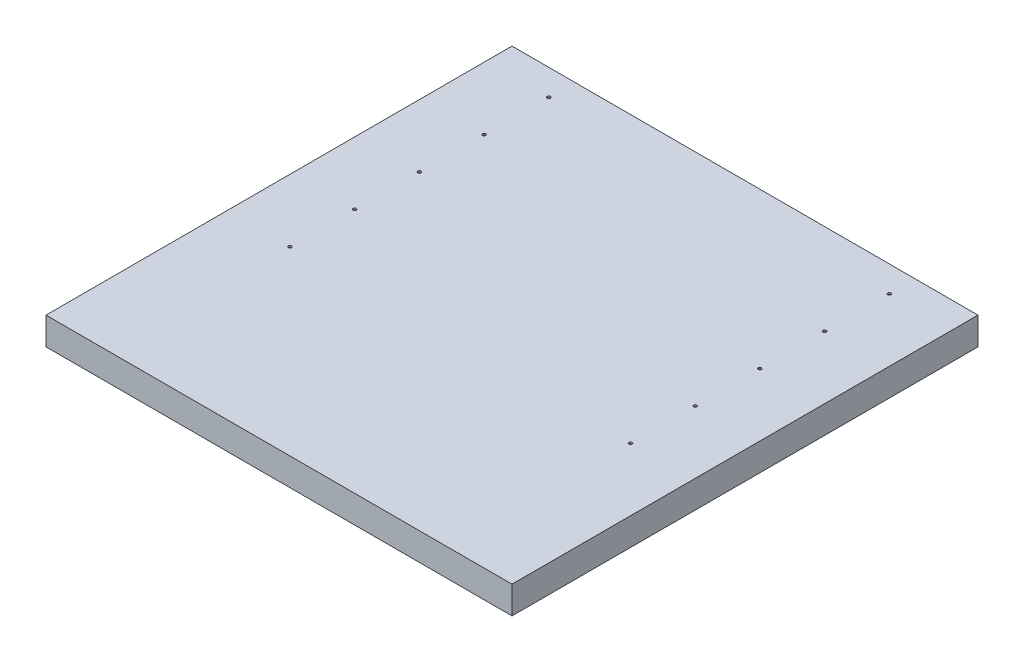
ISO-10303-21;
HEADER;
FILE_DESCRIPTION(('STEP AP214'),'2;1');
FILE_NAME('part.step','',(''),(''),'','','');
FILE_SCHEMA(('AUTOMOTIVE_DESIGN { 1 0 10303 214 1 1 1 1 }'));
ENDSEC;
DATA;
#1=APPLICATION_CONTEXT('core data for automotive mechanical design processes');
#2=APPLICATION_PROTOCOL_DEFINITION('international standard','automotive_design',2000,#1);
#3=PRODUCT_CONTEXT('',#1,'mechanical');
#4=PRODUCT('Part','Part','',(#3));
#5=PRODUCT_RELATED_PRODUCT_CATEGORY('part','',(#4));
#6=PRODUCT_DEFINITION_FORMATION('','',#4);
#7=PRODUCT_DEFINITION_CONTEXT('part definition',#1,'design');
#8=PRODUCT_DEFINITION('design','',#6,#7);
#9=PRODUCT_DEFINITION_SHAPE('','',#8);
#10=(LENGTH_UNIT() NAMED_UNIT(*) SI_UNIT(.MILLI.,.METRE.));
#11=(NAMED_UNIT(*) PLANE_ANGLE_UNIT() SI_UNIT($,.RADIAN.));
#12=(NAMED_UNIT(*) SI_UNIT($,.STERADIAN.) SOLID_ANGLE_UNIT());
#13=UNCERTAINTY_MEASURE_WITH_UNIT(LENGTH_MEASURE(1.E-05),#10,'distance_accuracy_value','');
#14=(GEOMETRIC_REPRESENTATION_CONTEXT(3) GLOBAL_UNCERTAINTY_ASSIGNED_CONTEXT((#13)) GLOBAL_UNIT_ASSIGNED_CONTEXT((#10,
#11,#12)) REPRESENTATION_CONTEXT('',''));
#15=CARTESIAN_POINT('',(0.,0.,0.));
#16=DIRECTION('',(0.,0.,1.));
#17=DIRECTION('',(1.,0.,0.));
#18=AXIS2_PLACEMENT_3D('',#15,#16,#17);
#19=CARTESIAN_POINT('',(0.,3.175,0.));
#20=DIRECTION('',(0.,-1.,0.));
#21=DIRECTION('',(0.,0.,-1.));
#22=AXIS2_PLACEMENT_3D('',#19,#20,#21);
#23=PLANE('',#22);
#24=DIRECTION('',(0.,0.,-1.));
#25=VECTOR('',#24,1.);
#26=CARTESIAN_POINT('',(457.2,3.175,457.2));
#27=LINE('',#26,#25);
#28=CARTESIAN_POINT('',(457.2,3.175,457.2));
#29=VERTEX_POINT('',#28);
#30=CARTESIAN_POINT('',(457.2,3.175,-457.2));
#31=VERTEX_POINT('',#30);
#32=EDGE_CURVE('E246',#29,#31,#27,.T.);
#33=ORIENTED_EDGE('',*,*,#32,.T.);
#34=DIRECTION('',(-1.,0.,0.));
#35=VECTOR('',#34,1.);
#36=CARTESIAN_POINT('',(-457.2,3.175,-457.2));
#37=LINE('',#36,#35);
#38=CARTESIAN_POINT('',(-457.2,3.175,-457.2));
#39=VERTEX_POINT('',#38);
#40=EDGE_CURVE('E253',#31,#39,#37,.T.);
#41=ORIENTED_EDGE('',*,*,#40,.T.);
#42=DIRECTION('',(0.,0.,1.));
#43=VECTOR('',#42,1.);
#44=CARTESIAN_POINT('',(-457.2,3.175,457.2));
#45=LINE('',#44,#43);
#46=CARTESIAN_POINT('',(-457.2,3.175,457.2));
#47=VERTEX_POINT('',#46);
#48=EDGE_CURVE('E256',#39,#47,#45,.T.);
#49=ORIENTED_EDGE('',*,*,#48,.T.);
#50=DIRECTION('',(1.,0.,0.));
#51=VECTOR('',#50,1.);
#52=CARTESIAN_POINT('',(-457.2,3.175,457.2));
#53=LINE('',#52,#51);
#54=EDGE_CURVE('E259',#47,#29,#53,.T.);
#55=ORIENTED_EDGE('',*,*,#54,.T.);
#56=EDGE_LOOP('',(#33,#41,#49,#55));
#57=FACE_BOUND('',#56,.T.);
#58=CARTESIAN_POINT('',(-334.137,3.175,-406.4));
#59=DIRECTION('',(0.,1.,0.));
#60=DIRECTION('',(0.,0.,1.));
#61=AXIS2_PLACEMENT_3D('',#58,#59,#60);
#62=CIRCLE('',#61,3.17499999999997);
#63=CARTESIAN_POINT('',(-334.137,3.175,-403.225));
#64=VERTEX_POINT('',#63);
#65=EDGE_CURVE('E242',#64,#64,#62,.T.);
#66=ORIENTED_EDGE('',*,*,#65,.F.);
#67=EDGE_LOOP('',(#66));
#68=FACE_BOUND('',#67,.T.);
#69=CARTESIAN_POINT('',(334.136999999995,3.175,101.6));
#70=DIRECTION('',(0.,1.,0.));
#71=DIRECTION('',(0.,0.,-1.));
#72=AXIS2_PLACEMENT_3D('',#69,#70,#71);
#73=CIRCLE('',#72,3.17499999999997);
#74=CARTESIAN_POINT('',(334.136999999995,3.175,98.4250000000001));
#75=VERTEX_POINT('',#74);
#76=EDGE_CURVE('E234',#75,#75,#73,.T.);
#77=ORIENTED_EDGE('',*,*,#76,.F.);
#78=EDGE_LOOP('',(#77));
#79=FACE_BOUND('',#78,.T.);
#80=CARTESIAN_POINT('',(-334.136999999999,3.175,-279.4));
#81=DIRECTION('',(0.,1.,0.));
#82=DIRECTION('',(0.,0.,1.));
#83=AXIS2_PLACEMENT_3D('',#80,#81,#82);
#84=CIRCLE('',#83,3.17499999999997);
#85=CARTESIAN_POINT('',(-334.136999999999,3.175,-276.225));
#86=VERTEX_POINT('',#85);
#87=EDGE_CURVE('E226',#86,#86,#84,.T.);
#88=ORIENTED_EDGE('',*,*,#87,.F.);
#89=EDGE_LOOP('',(#88));
#90=FACE_BOUND('',#89,.T.);
#91=CARTESIAN_POINT('',(-334.136999999997,3.175,-152.4));
#92=DIRECTION('',(0.,1.,0.));
#93=DIRECTION('',(0.,0.,1.));
#94=AXIS2_PLACEMENT_3D('',#91,#92,#93);
#95=CIRCLE('',#94,3.17499999999997);
#96=CARTESIAN_POINT('',(-334.136999999997,3.175,-149.225));
#97=VERTEX_POINT('',#96);
#98=EDGE_CURVE('E218',#97,#97,#95,.T.);
#99=ORIENTED_EDGE('',*,*,#98,.F.);
#100=EDGE_LOOP('',(#99));
#101=FACE_BOUND('',#100,.T.);
#102=CARTESIAN_POINT('',(-334.136999999996,3.175,-25.4));
#103=DIRECTION('',(0.,1.,0.));
#104=DIRECTION('',(0.,0.,1.));
#105=AXIS2_PLACEMENT_3D('',#102,#103,#104);
#106=CIRCLE('',#105,3.17499999999997);
#107=CARTESIAN_POINT('',(-334.136999999996,3.175,-22.225));
#108=VERTEX_POINT('',#107);
#109=EDGE_CURVE('E210',#108,#108,#106,.T.);
#110=ORIENTED_EDGE('',*,*,#109,.F.);
#111=EDGE_LOOP('',(#110));
#112=FACE_BOUND('',#111,.T.);
#113=CARTESIAN_POINT('',(-334.136999999995,3.175,101.6));
#114=DIRECTION('',(0.,1.,0.));
#115=DIRECTION('',(0.,0.,1.));
#116=AXIS2_PLACEMENT_3D('',#113,#114,#115);
#117=CIRCLE('',#116,3.17499999999997);
#118=CARTESIAN_POINT('',(-334.136999999995,3.175,104.775));
#119=VERTEX_POINT('',#118);
#120=EDGE_CURVE('E202',#119,#119,#117,.T.);
#121=ORIENTED_EDGE('',*,*,#120,.F.);
#122=EDGE_LOOP('',(#121));
#123=FACE_BOUND('',#122,.T.);
#124=CARTESIAN_POINT('',(334.136999999996,3.175,-25.4));
#125=DIRECTION('',(0.,1.,0.));
#126=DIRECTION('',(0.,0.,-1.));
#127=AXIS2_PLACEMENT_3D('',#124,#125,#126);
#128=CIRCLE('',#127,3.17499999999997);
#129=CARTESIAN_POINT('',(334.136999999996,3.175,-28.5749999999999));
#130=VERTEX_POINT('',#129);
#131=EDGE_CURVE('E194',#130,#130,#128,.T.);
#132=ORIENTED_EDGE('',*,*,#131,.F.);
#133=EDGE_LOOP('',(#132));
#134=FACE_BOUND('',#133,.T.);
#135=CARTESIAN_POINT('',(334.136999999997,3.175,-152.4));
#136=DIRECTION('',(0.,1.,0.));
#137=DIRECTION('',(0.,0.,-1.));
#138=AXIS2_PLACEMENT_3D('',#135,#136,#137);
#139=CIRCLE('',#138,3.17499999999997);
#140=CARTESIAN_POINT('',(334.136999999997,3.175,-155.575));
#141=VERTEX_POINT('',#140);
#142=EDGE_CURVE('E186',#141,#141,#139,.T.);
#143=ORIENTED_EDGE('',*,*,#142,.F.);
#144=EDGE_LOOP('',(#143));
#145=FACE_BOUND('',#144,.T.);
#146=CARTESIAN_POINT('',(334.136999999999,3.175,-279.4));
#147=DIRECTION('',(0.,1.,0.));
#148=DIRECTION('',(0.,0.,-1.));
#149=AXIS2_PLACEMENT_3D('',#146,#147,#148);
#150=CIRCLE('',#149,3.17499999999997);
#151=CARTESIAN_POINT('',(334.136999999999,3.175,-282.575));
#152=VERTEX_POINT('',#151);
#153=EDGE_CURVE('E178',#152,#152,#150,.T.);
#154=ORIENTED_EDGE('',*,*,#153,.F.);
#155=EDGE_LOOP('',(#154));
#156=FACE_BOUND('',#155,.T.);
#157=CARTESIAN_POINT('',(334.137,3.175,-406.4));
#158=DIRECTION('',(0.,1.,0.));
#159=DIRECTION('',(0.,0.,-1.));
#160=AXIS2_PLACEMENT_3D('',#157,#158,#159);
#161=CIRCLE('',#160,3.17499999999997);
#162=CARTESIAN_POINT('',(334.137,3.175,-409.575));
#163=VERTEX_POINT('',#162);
#164=EDGE_CURVE('E170',#163,#163,#161,.T.);
#165=ORIENTED_EDGE('',*,*,#164,.F.);
#166=EDGE_LOOP('',(#165));
#167=FACE_BOUND('',#166,.T.);
#168=ADVANCED_FACE('F41',(#57,#68,#79,#90,#101,#112,#123,#134,#145,#156,#167),#23,.F.);
#169=CARTESIAN_POINT('',(0.,0.,0.));
#170=DIRECTION('',(0.,-1.,0.));
#171=DIRECTION('',(0.,0.,-1.));
#172=AXIS2_PLACEMENT_3D('',#169,#170,#171);
#173=PLANE('',#172);
#174=DIRECTION('',(0.,0.,-1.));
#175=VECTOR('',#174,1.);
#176=CARTESIAN_POINT('',(-454.025,0.,-454.025));
#177=LINE('',#176,#175);
#178=CARTESIAN_POINT('',(-454.025,0.,454.025));
#179=VERTEX_POINT('',#178);
#180=CARTESIAN_POINT('',(-454.025,0.,-454.025));
#181=VERTEX_POINT('',#180);
#182=EDGE_CURVE('E57',#179,#181,#177,.T.);
#183=ORIENTED_EDGE('',*,*,#182,.T.);
#184=DIRECTION('',(1.,0.,0.));
#185=VECTOR('',#184,1.);
#186=CARTESIAN_POINT('',(454.025,0.,-454.025));
#187=LINE('',#186,#185);
#188=CARTESIAN_POINT('',(454.025,0.,-454.025));
#189=VERTEX_POINT('',#188);
#190=EDGE_CURVE('E61',#181,#189,#187,.T.);
#191=ORIENTED_EDGE('',*,*,#190,.T.);
#192=DIRECTION('',(0.,0.,1.));
#193=VECTOR('',#192,1.);
#194=CARTESIAN_POINT('',(454.025,0.,454.025));
#195=LINE('',#194,#193);
#196=CARTESIAN_POINT('',(454.025,0.,454.025));
#197=VERTEX_POINT('',#196);
#198=EDGE_CURVE('E141',#189,#197,#195,.T.);
#199=ORIENTED_EDGE('',*,*,#198,.T.);
#200=DIRECTION('',(-1.,0.,0.));
#201=VECTOR('',#200,1.);
#202=CARTESIAN_POINT('',(-454.025,0.,454.025));
#203=LINE('',#202,#201);
#204=EDGE_CURVE('E116',#197,#179,#203,.T.);
#205=ORIENTED_EDGE('',*,*,#204,.T.);
#206=EDGE_LOOP('',(#183,#191,#199,#205));
#207=FACE_BOUND('',#206,.T.);
#208=CARTESIAN_POINT('',(334.136999999999,0.,-279.4));
#209=DIRECTION('',(0.,1.,0.));
#210=DIRECTION('',(0.,0.,-1.));
#211=AXIS2_PLACEMENT_3D('',#208,#209,#210);
#212=CIRCLE('',#211,3.17499999999997);
#213=CARTESIAN_POINT('',(334.136999999999,0.,-282.575));
#214=VERTEX_POINT('',#213);
#215=EDGE_CURVE('E174',#214,#214,#212,.T.);
#216=ORIENTED_EDGE('',*,*,#215,.T.);
#217=EDGE_LOOP('',(#216));
#218=FACE_BOUND('',#217,.T.);
#219=CARTESIAN_POINT('',(334.136999999996,0.,-25.4));
#220=DIRECTION('',(0.,1.,0.));
#221=DIRECTION('',(0.,0.,-1.));
#222=AXIS2_PLACEMENT_3D('',#219,#220,#221);
#223=CIRCLE('',#222,3.17499999999997);
#224=CARTESIAN_POINT('',(334.136999999996,0.,-28.5749999999999));
#225=VERTEX_POINT('',#224);
#226=EDGE_CURVE('E190',#225,#225,#223,.T.);
#227=ORIENTED_EDGE('',*,*,#226,.T.);
#228=EDGE_LOOP('',(#227));
#229=FACE_BOUND('',#228,.T.);
#230=CARTESIAN_POINT('',(-334.136999999996,0.,-25.4));
#231=DIRECTION('',(0.,1.,0.));
#232=DIRECTION('',(0.,0.,1.));
#233=AXIS2_PLACEMENT_3D('',#230,#231,#232);
#234=CIRCLE('',#233,3.17499999999997);
#235=CARTESIAN_POINT('',(-334.136999999996,0.,-22.225));
#236=VERTEX_POINT('',#235);
#237=EDGE_CURVE('E206',#236,#236,#234,.T.);
#238=ORIENTED_EDGE('',*,*,#237,.T.);
#239=EDGE_LOOP('',(#238));
#240=FACE_BOUND('',#239,.T.);
#241=CARTESIAN_POINT('',(-334.136999999999,0.,-279.4));
#242=DIRECTION('',(0.,1.,0.));
#243=DIRECTION('',(0.,0.,1.));
#244=AXIS2_PLACEMENT_3D('',#241,#242,#243);
#245=CIRCLE('',#244,3.17499999999997);
#246=CARTESIAN_POINT('',(-334.136999999999,0.,-276.225));
#247=VERTEX_POINT('',#246);
#248=EDGE_CURVE('E222',#247,#247,#245,.T.);
#249=ORIENTED_EDGE('',*,*,#248,.T.);
#250=EDGE_LOOP('',(#249));
#251=FACE_BOUND('',#250,.T.);
#252=CARTESIAN_POINT('',(-334.137,0.,-406.4));
#253=DIRECTION('',(0.,1.,0.));
#254=DIRECTION('',(0.,0.,1.));
#255=AXIS2_PLACEMENT_3D('',#252,#253,#254);
#256=CIRCLE('',#255,3.17499999999997);
#257=CARTESIAN_POINT('',(-334.137,0.,-403.225));
#258=VERTEX_POINT('',#257);
#259=EDGE_CURVE('E238',#258,#258,#256,.T.);
#260=ORIENTED_EDGE('',*,*,#259,.T.);
#261=EDGE_LOOP('',(#260));
#262=FACE_BOUND('',#261,.T.);
#263=CARTESIAN_POINT('',(334.136999999995,0.,101.6));
#264=DIRECTION('',(0.,1.,0.));
#265=DIRECTION('',(0.,0.,-1.));
#266=AXIS2_PLACEMENT_3D('',#263,#264,#265);
#267=CIRCLE('',#266,3.17499999999997);
#268=CARTESIAN_POINT('',(334.136999999995,0.,98.4250000000001));
#269=VERTEX_POINT('',#268);
#270=EDGE_CURVE('E230',#269,#269,#267,.T.);
#271=ORIENTED_EDGE('',*,*,#270,.T.);
#272=EDGE_LOOP('',(#271));
#273=FACE_BOUND('',#272,.T.);
#274=CARTESIAN_POINT('',(-334.136999999997,0.,-152.4));
#275=DIRECTION('',(0.,1.,0.));
#276=DIRECTION('',(0.,0.,1.));
#277=AXIS2_PLACEMENT_3D('',#274,#275,#276);
#278=CIRCLE('',#277,3.17499999999997);
#279=CARTESIAN_POINT('',(-334.136999999997,0.,-149.225));
#280=VERTEX_POINT('',#279);
#281=EDGE_CURVE('E214',#280,#280,#278,.T.);
#282=ORIENTED_EDGE('',*,*,#281,.T.);
#283=EDGE_LOOP('',(#282));
#284=FACE_BOUND('',#283,.T.);
#285=CARTESIAN_POINT('',(-334.136999999995,0.,101.6));
#286=DIRECTION('',(0.,1.,0.));
#287=DIRECTION('',(0.,0.,1.));
#288=AXIS2_PLACEMENT_3D('',#285,#286,#287);
#289=CIRCLE('',#288,3.17499999999997);
#290=CARTESIAN_POINT('',(-334.136999999995,0.,104.775));
#291=VERTEX_POINT('',#290);
#292=EDGE_CURVE('E198',#291,#291,#289,.T.);
#293=ORIENTED_EDGE('',*,*,#292,.T.);
#294=EDGE_LOOP('',(#293));
#295=FACE_BOUND('',#294,.T.);
#296=CARTESIAN_POINT('',(334.136999999997,0.,-152.4));
#297=DIRECTION('',(0.,1.,0.));
#298=DIRECTION('',(0.,0.,-1.));
#299=AXIS2_PLACEMENT_3D('',#296,#297,#298);
#300=CIRCLE('',#299,3.17499999999997);
#301=CARTESIAN_POINT('',(334.136999999997,0.,-155.575));
#302=VERTEX_POINT('',#301);
#303=EDGE_CURVE('E182',#302,#302,#300,.T.);
#304=ORIENTED_EDGE('',*,*,#303,.T.);
#305=EDGE_LOOP('',(#304));
#306=FACE_BOUND('',#305,.T.);
#307=CARTESIAN_POINT('',(334.137,0.,-406.4));
#308=DIRECTION('',(0.,1.,0.));
#309=DIRECTION('',(0.,0.,-1.));
#310=AXIS2_PLACEMENT_3D('',#307,#308,#309);
#311=CIRCLE('',#310,3.17499999999997);
#312=CARTESIAN_POINT('',(334.137,0.,-409.575));
#313=VERTEX_POINT('',#312);
#314=EDGE_CURVE('E169',#313,#313,#311,.T.);
#315=ORIENTED_EDGE('',*,*,#314,.T.);
#316=EDGE_LOOP('',(#315));
#317=FACE_BOUND('',#316,.T.);
#318=ADVANCED_FACE('F290',(#207,#218,#229,#240,#251,#262,#273,#284,#295,#306,#317),#173,.T.);
#319=CARTESIAN_POINT('',(457.2,3.175,457.2));
#320=DIRECTION('',(-1.,0.,0.));
#321=DIRECTION('',(0.,0.,1.));
#322=AXIS2_PLACEMENT_3D('',#319,#320,#321);
#323=PLANE('',#322);
#324=DIRECTION('',(0.,-1.,0.));
#325=VECTOR('',#324,1.);
#326=CARTESIAN_POINT('',(457.2,3.175,457.2));
#327=LINE('',#326,#325);
#328=CARTESIAN_POINT('',(457.2,-50.8,457.2));
#329=VERTEX_POINT('',#328);
#330=EDGE_CURVE('E262',#29,#329,#327,.T.);
#331=ORIENTED_EDGE('',*,*,#330,.T.);
#332=DIRECTION('',(0.,0.,1.));
#333=VECTOR('',#332,1.);
#334=CARTESIAN_POINT('',(457.2,-50.8,457.2));
#335=LINE('',#334,#333);
#336=CARTESIAN_POINT('',(457.2,-50.8,-457.2));
#337=VERTEX_POINT('',#336);
#338=EDGE_CURVE('E165',#337,#329,#335,.T.);
#339=ORIENTED_EDGE('',*,*,#338,.F.);
#340=DIRECTION('',(0.,-1.,0.));
#341=VECTOR('',#340,1.);
#342=CARTESIAN_POINT('',(457.2,3.175,-457.2));
#343=LINE('',#342,#341);
#344=EDGE_CURVE('E11',#31,#337,#343,.T.);
#345=ORIENTED_EDGE('',*,*,#344,.F.);
#346=ORIENTED_EDGE('',*,*,#32,.F.);
#347=EDGE_LOOP('',(#331,#339,#345,#346));
#348=FACE_BOUND('',#347,.T.);
#349=ADVANCED_FACE('F43',(#348),#323,.F.);
#350=CARTESIAN_POINT('',(-457.2,3.175,-457.2));
#351=DIRECTION('',(0.,0.,1.));
#352=DIRECTION('',(1.,0.,0.));
#353=AXIS2_PLACEMENT_3D('',#350,#351,#352);
#354=PLANE('',#353);
#355=ORIENTED_EDGE('',*,*,#344,.T.);
#356=DIRECTION('',(1.,0.,0.));
#357=VECTOR('',#356,1.);
#358=CARTESIAN_POINT('',(457.2,-50.8,-457.2));
#359=LINE('',#358,#357);
#360=CARTESIAN_POINT('',(-457.2,-50.8,-457.2));
#361=VERTEX_POINT('',#360);
#362=EDGE_CURVE('E161',#361,#337,#359,.T.);
#363=ORIENTED_EDGE('',*,*,#362,.F.);
#364=DIRECTION('',(0.,-1.,0.));
#365=VECTOR('',#364,1.);
#366=CARTESIAN_POINT('',(-457.2,3.175,-457.2));
#367=LINE('',#366,#365);
#368=EDGE_CURVE('E50',#39,#361,#367,.T.);
#369=ORIENTED_EDGE('',*,*,#368,.F.);
#370=ORIENTED_EDGE('',*,*,#40,.F.);
#371=EDGE_LOOP('',(#355,#363,#369,#370));
#372=FACE_BOUND('',#371,.T.);
#373=ADVANCED_FACE('F279',(#372),#354,.F.);
#374=CARTESIAN_POINT('',(-457.2,3.175,457.2));
#375=DIRECTION('',(1.,0.,0.));
#376=DIRECTION('',(0.,0.,-1.));
#377=AXIS2_PLACEMENT_3D('',#374,#375,#376);
#378=PLANE('',#377);
#379=ORIENTED_EDGE('',*,*,#368,.T.);
#380=DIRECTION('',(0.,0.,-1.));
#381=VECTOR('',#380,1.);
#382=CARTESIAN_POINT('',(-457.2,-50.8,-457.2));
#383=LINE('',#382,#381);
#384=CARTESIAN_POINT('',(-457.2,-50.8,457.2));
#385=VERTEX_POINT('',#384);
#386=EDGE_CURVE('E157',#385,#361,#383,.T.);
#387=ORIENTED_EDGE('',*,*,#386,.F.);
#388=DIRECTION('',(0.,-1.,0.));
#389=VECTOR('',#388,1.);
#390=CARTESIAN_POINT('',(-457.2,3.175,457.2));
#391=LINE('',#390,#389);
#392=EDGE_CURVE('E265',#47,#385,#391,.T.);
#393=ORIENTED_EDGE('',*,*,#392,.F.);
#394=ORIENTED_EDGE('',*,*,#48,.F.);
#395=EDGE_LOOP('',(#379,#387,#393,#394));
#396=FACE_BOUND('',#395,.T.);
#397=ADVANCED_FACE('F272',(#396),#378,.F.);
#398=CARTESIAN_POINT('',(-457.2,3.175,457.2));
#399=DIRECTION('',(0.,0.,-1.));
#400=DIRECTION('',(-1.,0.,0.));
#401=AXIS2_PLACEMENT_3D('',#398,#399,#400);
#402=PLANE('',#401);
#403=ORIENTED_EDGE('',*,*,#392,.T.);
#404=DIRECTION('',(-1.,0.,0.));
#405=VECTOR('',#404,1.);
#406=CARTESIAN_POINT('',(-457.2,-50.8,457.2));
#407=LINE('',#406,#405);
#408=EDGE_CURVE('E122',#329,#385,#407,.T.);
#409=ORIENTED_EDGE('',*,*,#408,.F.);
#410=ORIENTED_EDGE('',*,*,#330,.F.);
#411=ORIENTED_EDGE('',*,*,#54,.F.);
#412=EDGE_LOOP('',(#403,#409,#410,#411));
#413=FACE_BOUND('',#412,.T.);
#414=ADVANCED_FACE('F285',(#413),#402,.F.);
#415=CARTESIAN_POINT('',(-334.137,3.175,-406.4));
#416=DIRECTION('',(0.,-1.,0.));
#417=DIRECTION('',(0.,0.,-1.));
#418=AXIS2_PLACEMENT_3D('',#415,#416,#417);
#419=CYLINDRICAL_SURFACE('',#418,3.17499999999997);
#420=ORIENTED_EDGE('',*,*,#65,.T.);
#421=EDGE_LOOP('',(#420));
#422=FACE_BOUND('',#421,.T.);
#423=ORIENTED_EDGE('',*,*,#259,.F.);
#424=EDGE_LOOP('',(#423));
#425=FACE_BOUND('',#424,.T.);
#426=ADVANCED_FACE('F329',(#422,#425),#419,.F.);
#427=CARTESIAN_POINT('',(334.136999999995,3.175,101.6));
#428=DIRECTION('',(0.,-1.,0.));
#429=DIRECTION('',(0.,0.,-1.));
#430=AXIS2_PLACEMENT_3D('',#427,#428,#429);
#431=CYLINDRICAL_SURFACE('',#430,3.17499999999997);
#432=ORIENTED_EDGE('',*,*,#76,.T.);
#433=EDGE_LOOP('',(#432));
#434=FACE_BOUND('',#433,.T.);
#435=ORIENTED_EDGE('',*,*,#270,.F.);
#436=EDGE_LOOP('',(#435));
#437=FACE_BOUND('',#436,.T.);
#438=ADVANCED_FACE('F351',(#434,#437),#431,.F.);
#439=CARTESIAN_POINT('',(-334.136999999999,3.175,-279.4));
#440=DIRECTION('',(0.,-1.,0.));
#441=DIRECTION('',(0.,0.,-1.));
#442=AXIS2_PLACEMENT_3D('',#439,#440,#441);
#443=CYLINDRICAL_SURFACE('',#442,3.17499999999997);
#444=ORIENTED_EDGE('',*,*,#87,.T.);
#445=EDGE_LOOP('',(#444));
#446=FACE_BOUND('',#445,.T.);
#447=ORIENTED_EDGE('',*,*,#248,.F.);
#448=EDGE_LOOP('',(#447));
#449=FACE_BOUND('',#448,.T.);
#450=ADVANCED_FACE('F359',(#446,#449),#443,.F.);
#451=CARTESIAN_POINT('',(-334.136999999997,3.175,-152.4));
#452=DIRECTION('',(0.,-1.,0.));
#453=DIRECTION('',(0.,0.,-1.));
#454=AXIS2_PLACEMENT_3D('',#451,#452,#453);
#455=CYLINDRICAL_SURFACE('',#454,3.17499999999997);
#456=ORIENTED_EDGE('',*,*,#98,.T.);
#457=EDGE_LOOP('',(#456));
#458=FACE_BOUND('',#457,.T.);
#459=ORIENTED_EDGE('',*,*,#281,.F.);
#460=EDGE_LOOP('',(#459));
#461=FACE_BOUND('',#460,.T.);
#462=ADVANCED_FACE('F367',(#458,#461),#455,.F.);
#463=CARTESIAN_POINT('',(-334.136999999996,3.175,-25.4));
#464=DIRECTION('',(0.,-1.,0.));
#465=DIRECTION('',(0.,0.,-1.));
#466=AXIS2_PLACEMENT_3D('',#463,#464,#465);
#467=CYLINDRICAL_SURFACE('',#466,3.17499999999997);
#468=ORIENTED_EDGE('',*,*,#109,.T.);
#469=EDGE_LOOP('',(#468));
#470=FACE_BOUND('',#469,.T.);
#471=ORIENTED_EDGE('',*,*,#237,.F.);
#472=EDGE_LOOP('',(#471));
#473=FACE_BOUND('',#472,.T.);
#474=ADVANCED_FACE('F375',(#470,#473),#467,.F.);
#475=CARTESIAN_POINT('',(-334.136999999995,3.175,101.6));
#476=DIRECTION('',(0.,-1.,0.));
#477=DIRECTION('',(0.,0.,-1.));
#478=AXIS2_PLACEMENT_3D('',#475,#476,#477);
#479=CYLINDRICAL_SURFACE('',#478,3.17499999999997);
#480=ORIENTED_EDGE('',*,*,#120,.T.);
#481=EDGE_LOOP('',(#480));
#482=FACE_BOUND('',#481,.T.);
#483=ORIENTED_EDGE('',*,*,#292,.F.);
#484=EDGE_LOOP('',(#483));
#485=FACE_BOUND('',#484,.T.);
#486=ADVANCED_FACE('F383',(#482,#485),#479,.F.);
#487=CARTESIAN_POINT('',(334.136999999996,3.175,-25.4));
#488=DIRECTION('',(0.,-1.,0.));
#489=DIRECTION('',(0.,0.,-1.));
#490=AXIS2_PLACEMENT_3D('',#487,#488,#489);
#491=CYLINDRICAL_SURFACE('',#490,3.17499999999997);
#492=ORIENTED_EDGE('',*,*,#131,.T.);
#493=EDGE_LOOP('',(#492));
#494=FACE_BOUND('',#493,.T.);
#495=ORIENTED_EDGE('',*,*,#226,.F.);
#496=EDGE_LOOP('',(#495));
#497=FACE_BOUND('',#496,.T.);
#498=ADVANCED_FACE('F391',(#494,#497),#491,.F.);
#499=CARTESIAN_POINT('',(334.136999999997,3.175,-152.4));
#500=DIRECTION('',(0.,-1.,0.));
#501=DIRECTION('',(0.,0.,-1.));
#502=AXIS2_PLACEMENT_3D('',#499,#500,#501);
#503=CYLINDRICAL_SURFACE('',#502,3.17499999999997);
#504=ORIENTED_EDGE('',*,*,#142,.T.);
#505=EDGE_LOOP('',(#504));
#506=FACE_BOUND('',#505,.T.);
#507=ORIENTED_EDGE('',*,*,#303,.F.);
#508=EDGE_LOOP('',(#507));
#509=FACE_BOUND('',#508,.T.);
#510=ADVANCED_FACE('F399',(#506,#509),#503,.F.);
#511=CARTESIAN_POINT('',(334.136999999999,3.175,-279.4));
#512=DIRECTION('',(0.,-1.,0.));
#513=DIRECTION('',(0.,0.,-1.));
#514=AXIS2_PLACEMENT_3D('',#511,#512,#513);
#515=CYLINDRICAL_SURFACE('',#514,3.17499999999997);
#516=ORIENTED_EDGE('',*,*,#153,.T.);
#517=EDGE_LOOP('',(#516));
#518=FACE_BOUND('',#517,.T.);
#519=ORIENTED_EDGE('',*,*,#215,.F.);
#520=EDGE_LOOP('',(#519));
#521=FACE_BOUND('',#520,.T.);
#522=ADVANCED_FACE('F315',(#518,#521),#515,.F.);
#523=CARTESIAN_POINT('',(334.137,3.175,-406.4));
#524=DIRECTION('',(0.,-1.,0.));
#525=DIRECTION('',(0.,0.,-1.));
#526=AXIS2_PLACEMENT_3D('',#523,#524,#525);
#527=CYLINDRICAL_SURFACE('',#526,3.17499999999997);
#528=ORIENTED_EDGE('',*,*,#164,.T.);
#529=EDGE_LOOP('',(#528));
#530=FACE_BOUND('',#529,.T.);
#531=ORIENTED_EDGE('',*,*,#314,.F.);
#532=EDGE_LOOP('',(#531));
#533=FACE_BOUND('',#532,.T.);
#534=ADVANCED_FACE('F312',(#530,#533),#527,.F.);
#535=CARTESIAN_POINT('',(0.,-50.8,0.));
#536=DIRECTION('',(0.,1.,0.));
#537=DIRECTION('',(0.,0.,1.));
#538=AXIS2_PLACEMENT_3D('',#535,#536,#537);
#539=PLANE('',#538);
#540=ORIENTED_EDGE('',*,*,#408,.T.);
#541=ORIENTED_EDGE('',*,*,#386,.T.);
#542=ORIENTED_EDGE('',*,*,#362,.T.);
#543=ORIENTED_EDGE('',*,*,#338,.T.);
#544=EDGE_LOOP('',(#540,#541,#542,#543));
#545=FACE_BOUND('',#544,.T.);
#546=DIRECTION('',(0.,0.,-1.));
#547=VECTOR('',#546,1.);
#548=CARTESIAN_POINT('',(-454.025,-50.8,-454.025));
#549=LINE('',#548,#547);
#550=CARTESIAN_POINT('',(-454.025,-50.8,454.025));
#551=VERTEX_POINT('',#550);
#552=CARTESIAN_POINT('',(-454.025,-50.8,-454.025));
#553=VERTEX_POINT('',#552);
#554=EDGE_CURVE('E105',#551,#553,#549,.T.);
#555=ORIENTED_EDGE('',*,*,#554,.F.);
#556=DIRECTION('',(-1.,0.,0.));
#557=VECTOR('',#556,1.);
#558=CARTESIAN_POINT('',(-454.025,-50.8,454.025));
#559=LINE('',#558,#557);
#560=CARTESIAN_POINT('',(454.025,-50.8,454.025));
#561=VERTEX_POINT('',#560);
#562=EDGE_CURVE('E132',#561,#551,#559,.T.);
#563=ORIENTED_EDGE('',*,*,#562,.F.);
#564=DIRECTION('',(0.,0.,1.));
#565=VECTOR('',#564,1.);
#566=CARTESIAN_POINT('',(454.025,-50.8,454.025));
#567=LINE('',#566,#565);
#568=CARTESIAN_POINT('',(454.025,-50.8,-454.025));
#569=VERTEX_POINT('',#568);
#570=EDGE_CURVE('E128',#569,#561,#567,.T.);
#571=ORIENTED_EDGE('',*,*,#570,.F.);
#572=DIRECTION('',(1.,0.,0.));
#573=VECTOR('',#572,1.);
#574=CARTESIAN_POINT('',(454.025,-50.8,-454.025));
#575=LINE('',#574,#573);
#576=EDGE_CURVE('E115',#553,#569,#575,.T.);
#577=ORIENTED_EDGE('',*,*,#576,.F.);
#578=EDGE_LOOP('',(#555,#563,#571,#577));
#579=FACE_BOUND('',#578,.T.);
#580=ADVANCED_FACE('F126',(#545,#579),#539,.F.);
#581=CARTESIAN_POINT('',(-454.025,-50.8,-454.025));
#582=DIRECTION('',(1.,0.,0.));
#583=DIRECTION('',(0.,0.,-1.));
#584=AXIS2_PLACEMENT_3D('',#581,#582,#583);
#585=PLANE('',#584);
#586=ORIENTED_EDGE('',*,*,#182,.F.);
#587=DIRECTION('',(0.,1.,0.));
#588=VECTOR('',#587,1.);
#589=CARTESIAN_POINT('',(-454.025,-50.8,454.025));
#590=LINE('',#589,#588);
#591=EDGE_CURVE('E110',#551,#179,#590,.T.);
#592=ORIENTED_EDGE('',*,*,#591,.F.);
#593=ORIENTED_EDGE('',*,*,#554,.T.);
#594=DIRECTION('',(0.,1.,0.));
#595=VECTOR('',#594,1.);
#596=CARTESIAN_POINT('',(-454.025,-50.8,-454.025));
#597=LINE('',#596,#595);
#598=EDGE_CURVE('E108',#553,#181,#597,.T.);
#599=ORIENTED_EDGE('',*,*,#598,.T.);
#600=EDGE_LOOP('',(#586,#592,#593,#599));
#601=FACE_BOUND('',#600,.T.);
#602=ADVANCED_FACE('F107',(#601),#585,.T.);
#603=CARTESIAN_POINT('',(454.025,-50.8,-454.025));
#604=DIRECTION('',(0.,0.,1.));
#605=DIRECTION('',(1.,0.,0.));
#606=AXIS2_PLACEMENT_3D('',#603,#604,#605);
#607=PLANE('',#606);
#608=ORIENTED_EDGE('',*,*,#190,.F.);
#609=ORIENTED_EDGE('',*,*,#598,.F.);
#610=ORIENTED_EDGE('',*,*,#576,.T.);
#611=DIRECTION('',(0.,1.,0.));
#612=VECTOR('',#611,1.);
#613=CARTESIAN_POINT('',(454.025,-50.8,-454.025));
#614=LINE('',#613,#612);
#615=EDGE_CURVE('E123',#569,#189,#614,.T.);
#616=ORIENTED_EDGE('',*,*,#615,.T.);
#617=EDGE_LOOP('',(#608,#609,#610,#616));
#618=FACE_BOUND('',#617,.T.);
#619=ADVANCED_FACE('F119',(#618),#607,.T.);
#620=CARTESIAN_POINT('',(454.025,-50.8,454.025));
#621=DIRECTION('',(-1.,0.,0.));
#622=DIRECTION('',(0.,0.,1.));
#623=AXIS2_PLACEMENT_3D('',#620,#621,#622);
#624=PLANE('',#623);
#625=ORIENTED_EDGE('',*,*,#198,.F.);
#626=ORIENTED_EDGE('',*,*,#615,.F.);
#627=ORIENTED_EDGE('',*,*,#570,.T.);
#628=DIRECTION('',(0.,1.,0.));
#629=VECTOR('',#628,1.);
#630=CARTESIAN_POINT('',(454.025,-50.8,454.025));
#631=LINE('',#630,#629);
#632=EDGE_CURVE('E148',#561,#197,#631,.T.);
#633=ORIENTED_EDGE('',*,*,#632,.T.);
#634=EDGE_LOOP('',(#625,#626,#627,#633));
#635=FACE_BOUND('',#634,.T.);
#636=ADVANCED_FACE('F436',(#635),#624,.T.);
#637=CARTESIAN_POINT('',(-454.025,-50.8,454.025));
#638=DIRECTION('',(0.,0.,-1.));
#639=DIRECTION('',(-1.,0.,0.));
#640=AXIS2_PLACEMENT_3D('',#637,#638,#639);
#641=PLANE('',#640);
#642=ORIENTED_EDGE('',*,*,#204,.F.);
#643=ORIENTED_EDGE('',*,*,#632,.F.);
#644=ORIENTED_EDGE('',*,*,#562,.T.);
#645=ORIENTED_EDGE('',*,*,#591,.T.);
#646=EDGE_LOOP('',(#642,#643,#644,#645));
#647=FACE_BOUND('',#646,.T.);
#648=ADVANCED_FACE('F443',(#647),#641,.T.);
#649=CLOSED_SHELL('',(#168,#318,#349,#373,#397,#414,#426,#438,#450,#462,#474,#486,#498,#510,
#522,#534,#580,#602,#619,#636,#648));
#650=MANIFOLD_SOLID_BREP('B2',#649);
#651=ADVANCED_BREP_SHAPE_REPRESENTATION('',(#18,#650),#14);
#652=SHAPE_DEFINITION_REPRESENTATION(#9,#651);
ENDSEC;
END-ISO-10303-21;
